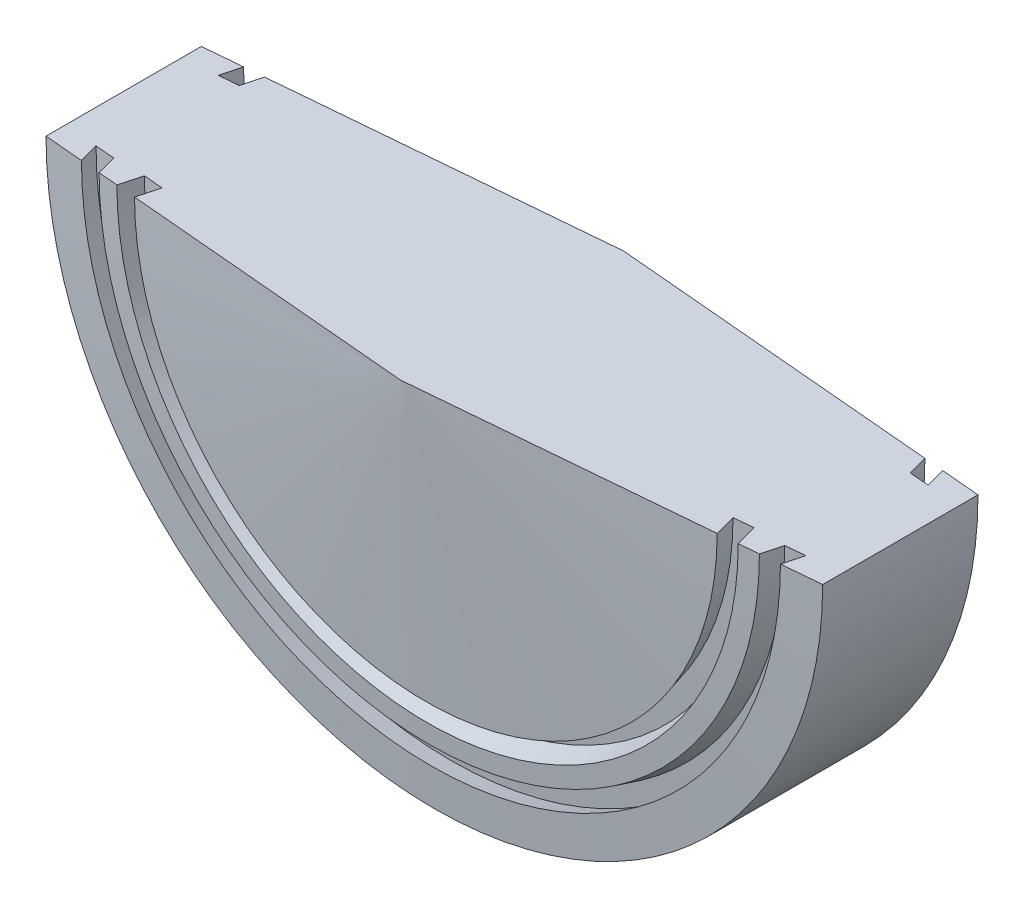
ISO-10303-21;
HEADER;
FILE_DESCRIPTION(('STEP AP214'),'2;1');
FILE_NAME('part.step','',(''),(''),'','','');
FILE_SCHEMA(('AUTOMOTIVE_DESIGN { 1 0 10303 214 1 1 1 1 }'));
ENDSEC;
DATA;
#1=APPLICATION_CONTEXT('core data for automotive mechanical design processes');
#2=APPLICATION_PROTOCOL_DEFINITION('international standard','automotive_design',2000,#1);
#3=PRODUCT_CONTEXT('',#1,'mechanical');
#4=PRODUCT('Part','Part','',(#3));
#5=PRODUCT_RELATED_PRODUCT_CATEGORY('part','',(#4));
#6=PRODUCT_DEFINITION_FORMATION('','',#4);
#7=PRODUCT_DEFINITION_CONTEXT('part definition',#1,'design');
#8=PRODUCT_DEFINITION('design','',#6,#7);
#9=PRODUCT_DEFINITION_SHAPE('','',#8);
#10=(LENGTH_UNIT() NAMED_UNIT(*) SI_UNIT(.MILLI.,.METRE.));
#11=(NAMED_UNIT(*) PLANE_ANGLE_UNIT() SI_UNIT($,.RADIAN.));
#12=(NAMED_UNIT(*) SI_UNIT($,.STERADIAN.) SOLID_ANGLE_UNIT());
#13=UNCERTAINTY_MEASURE_WITH_UNIT(LENGTH_MEASURE(1.E-05),#10,'distance_accuracy_value','');
#14=(GEOMETRIC_REPRESENTATION_CONTEXT(3) GLOBAL_UNCERTAINTY_ASSIGNED_CONTEXT((#13)) GLOBAL_UNIT_ASSIGNED_CONTEXT((#10,
#11,#12)) REPRESENTATION_CONTEXT('',''));
#15=CARTESIAN_POINT('',(0.,0.,0.));
#16=DIRECTION('',(0.,0.,1.));
#17=DIRECTION('',(1.,0.,0.));
#18=AXIS2_PLACEMENT_3D('',#15,#16,#17);
#19=CARTESIAN_POINT('',(0.,0.,18.25625));
#20=DIRECTION('',(0.,0.,-1.));
#21=DIRECTION('',(0.,1.,0.));
#22=AXIS2_PLACEMENT_3D('',#19,#20,#21);
#23=CONICAL_SURFACE('',#22,0.,1.48351861384544);
#24=CARTESIAN_POINT('',(0.,0.,14.0880050671419));
#25=DIRECTION('',(0.,0.,1.));
#26=DIRECTION('',(0.,-1.,0.));
#27=AXIS2_PLACEMENT_3D('',#24,#25,#26);
#28=CIRCLE('',#27,47.6370849469498);
#29=CARTESIAN_POINT('',(-47.6370849469498,1.69218207038058E-13,14.0880050671419));
#30=VERTEX_POINT('',#29);
#31=CARTESIAN_POINT('',(47.6370849469498,1.63736068582383E-13,14.0880050671419));
#32=VERTEX_POINT('',#31);
#33=EDGE_CURVE('E11',#30,#32,#28,.T.);
#34=ORIENTED_EDGE('',*,*,#33,.T.);
#35=DIRECTION('',(0.996193717496113,0.,-0.0871669502809096));
#36=VECTOR('',#35,1.);
#37=CARTESIAN_POINT('',(1.58528454023879,0.,18.1175376027291));
#38=LINE('',#37,#36);
#39=CARTESIAN_POINT('',(0.,0.,18.25625));
#40=VERTEX_POINT('',#39);
#41=EDGE_CURVE('E141',#40,#32,#38,.T.);
#42=ORIENTED_EDGE('',*,*,#41,.F.);
#43=DIRECTION('',(-0.996193717496113,0.,-0.0871669502809096));
#44=VECTOR('',#43,1.);
#45=CARTESIAN_POINT('',(-1.58528454023879,0.,18.1175376027291));
#46=LINE('',#45,#44);
#47=EDGE_CURVE('E143',#40,#30,#46,.T.);
#48=ORIENTED_EDGE('',*,*,#47,.T.);
#49=EDGE_LOOP('',(#34,#42,#48));
#50=FACE_BOUND('',#49,.T.);
#51=ADVANCED_FACE('F35',(#50),#23,.T.);
#52=CARTESIAN_POINT('',(0.,0.,10.545485948535));
#53=DIRECTION('',(0.,0.,1.));
#54=DIRECTION('',(0.,-1.,0.));
#55=AXIS2_PLACEMENT_3D('',#52,#53,#54);
#56=CONICAL_SURFACE('',#55,46.6878698099473,0.261799387799151);
#57=CARTESIAN_POINT('',(0.,0.,10.545485948535));
#58=DIRECTION('',(0.,0.,1.));
#59=DIRECTION('',(0.,-1.,0.));
#60=AXIS2_PLACEMENT_3D('',#57,#58,#59);
#61=CIRCLE('',#60,46.6878698099473);
#62=CARTESIAN_POINT('',(-46.6878698099473,1.66554790305594E-13,10.545485948535));
#63=VERTEX_POINT('',#62);
#64=CARTESIAN_POINT('',(46.6878698099473,1.6107265184992E-13,10.545485948535));
#65=VERTEX_POINT('',#64);
#66=EDGE_CURVE('E42',#63,#65,#61,.T.);
#67=ORIENTED_EDGE('',*,*,#66,.T.);
#68=DIRECTION('',(0.258819045102522,0.,0.965925826289068));
#69=VECTOR('',#68,1.);
#70=CARTESIAN_POINT('',(40.9240040698373,1.44899736082519E-13,-10.965553841561));
#71=LINE('',#70,#69);
#72=EDGE_CURVE('E151',#65,#32,#71,.T.);
#73=ORIENTED_EDGE('',*,*,#72,.T.);
#74=ORIENTED_EDGE('',*,*,#33,.F.);
#75=DIRECTION('',(-0.258819045102522,0.,0.965925826289068));
#76=VECTOR('',#75,1.);
#77=CARTESIAN_POINT('',(-40.9240040698373,1.50381874538193E-13,-10.965553841561));
#78=LINE('',#77,#76);
#79=EDGE_CURVE('E188',#63,#30,#78,.T.);
#80=ORIENTED_EDGE('',*,*,#79,.F.);
#81=EDGE_LOOP('',(#67,#73,#74,#80));
#82=FACE_BOUND('',#81,.T.);
#83=ADVANCED_FACE('F156',(#82),#56,.T.);
#84=CARTESIAN_POINT('',(0.,0.,10.2687308813931));
#85=DIRECTION('',(0.,0.,-1.));
#86=DIRECTION('',(0.,1.,0.));
#87=AXIS2_PLACEMENT_3D('',#84,#85,#86);
#88=CONICAL_SURFACE('',#87,49.8507848629974,1.48351861384544);
#89=CARTESIAN_POINT('',(0.,0.,10.2687308813931));
#90=DIRECTION('',(0.,0.,1.));
#91=DIRECTION('',(0.,-1.,0.));
#92=AXIS2_PLACEMENT_3D('',#89,#90,#91);
#93=CIRCLE('',#92,49.8507848629974);
#94=CARTESIAN_POINT('',(-49.8507848629974,1.77648888270733E-13,10.2687308813931));
#95=VERTEX_POINT('',#94);
#96=CARTESIAN_POINT('',(49.8507848629974,1.72166749815059E-13,10.2687308813931));
#97=VERTEX_POINT('',#96);
#98=EDGE_CURVE('E243',#95,#97,#93,.T.);
#99=ORIENTED_EDGE('',*,*,#98,.T.);
#100=DIRECTION('',(-0.996193717496113,0.,0.0871669502809094));
#101=VECTOR('',#100,1.);
#102=CARTESIAN_POINT('',(1.27045708665947,0.,14.5195095618226));
#103=LINE('',#102,#101);
#104=EDGE_CURVE('E157',#97,#65,#103,.T.);
#105=ORIENTED_EDGE('',*,*,#104,.T.);
#106=ORIENTED_EDGE('',*,*,#66,.F.);
#107=DIRECTION('',(0.996193717496113,0.,0.0871669502809094));
#108=VECTOR('',#107,1.);
#109=CARTESIAN_POINT('',(-1.27045708665947,0.,14.5195095618226));
#110=LINE('',#109,#108);
#111=EDGE_CURVE('E192',#95,#63,#110,.T.);
#112=ORIENTED_EDGE('',*,*,#111,.F.);
#113=EDGE_LOOP('',(#99,#105,#106,#112));
#114=FACE_BOUND('',#113,.T.);
#115=ADVANCED_FACE('F246',(#114),#88,.T.);
#116=CARTESIAN_POINT('',(0.,0.,13.81125));
#117=DIRECTION('',(0.,0.,1.));
#118=DIRECTION('',(0.,-1.,0.));
#119=AXIS2_PLACEMENT_3D('',#116,#117,#118);
#120=CONICAL_SURFACE('',#119,50.8,0.261799387799151);
#121=CARTESIAN_POINT('',(0.,0.,13.81125));
#122=DIRECTION('',(0.,0.,1.));
#123=DIRECTION('',(0.,-1.,0.));
#124=AXIS2_PLACEMENT_3D('',#121,#122,#123);
#125=CIRCLE('',#124,50.8);
#126=CARTESIAN_POINT('',(-50.8,1.80312305003197E-13,13.81125));
#127=VERTEX_POINT('',#126);
#128=CARTESIAN_POINT('',(50.8,1.74830166547523E-13,13.81125));
#129=VERTEX_POINT('',#128);
#130=EDGE_CURVE('E241',#127,#129,#125,.T.);
#131=ORIENTED_EDGE('',*,*,#130,.T.);
#132=DIRECTION('',(-0.258819045102522,0.,-0.965925826289068));
#133=VECTOR('',#132,1.);
#134=CARTESIAN_POINT('',(43.9442327561247,1.55593468269748E-13,-11.774821679009));
#135=LINE('',#134,#133);
#136=EDGE_CURVE('E159',#129,#97,#135,.T.);
#137=ORIENTED_EDGE('',*,*,#136,.T.);
#138=ORIENTED_EDGE('',*,*,#98,.F.);
#139=DIRECTION('',(0.258819045102522,0.,-0.965925826289068));
#140=VECTOR('',#139,1.);
#141=CARTESIAN_POINT('',(-43.9442327561247,1.61075606725422E-13,-11.774821679009));
#142=LINE('',#141,#140);
#143=EDGE_CURVE('E195',#127,#95,#142,.T.);
#144=ORIENTED_EDGE('',*,*,#143,.F.);
#145=EDGE_LOOP('',(#131,#137,#138,#144));
#146=FACE_BOUND('',#145,.T.);
#147=ADVANCED_FACE('F252',(#146),#120,.F.);
#148=CARTESIAN_POINT('',(0.,0.,13.81125));
#149=DIRECTION('',(0.,0.,-1.));
#150=DIRECTION('',(0.,1.,0.));
#151=AXIS2_PLACEMENT_3D('',#148,#149,#150);
#152=CONICAL_SURFACE('',#151,50.8,1.48351861384544);
#153=CARTESIAN_POINT('',(0.,0.,13.5323800671419));
#154=DIRECTION('',(0.,0.,1.));
#155=DIRECTION('',(0.,-1.,0.));
#156=AXIS2_PLACEMENT_3D('',#153,#154,#155);
#157=CIRCLE('',#156,53.9870849469498);
#158=CARTESIAN_POINT('',(-53.9870849469498,1.91491180196378E-13,13.5323800671419));
#159=VERTEX_POINT('',#158);
#160=CARTESIAN_POINT('',(53.9870849469498,1.86009041740704E-13,13.5323800671419));
#161=VERTEX_POINT('',#160);
#162=EDGE_CURVE('E239',#159,#161,#157,.T.);
#163=ORIENTED_EDGE('',*,*,#162,.T.);
#164=EDGE_CURVE('E155',#129,#161,#38,.T.);
#165=ORIENTED_EDGE('',*,*,#164,.F.);
#166=ORIENTED_EDGE('',*,*,#130,.F.);
#167=EDGE_CURVE('E190',#127,#159,#46,.T.);
#168=ORIENTED_EDGE('',*,*,#167,.T.);
#169=EDGE_LOOP('',(#163,#165,#166,#168));
#170=FACE_BOUND('',#169,.T.);
#171=ADVANCED_FACE('F256',(#170),#152,.T.);
#172=CARTESIAN_POINT('',(0.,0.,10.2687308813931));
#173=DIRECTION('',(0.,0.,-1.));
#174=DIRECTION('',(0.,1.,0.));
#175=AXIS2_PLACEMENT_3D('',#172,#173,#174);
#176=CONICAL_SURFACE('',#175,54.8615771106497,0.261799387799151);
#177=CARTESIAN_POINT('',(0.,0.,10.2687308813931));
#178=DIRECTION('',(0.,0.,1.));
#179=DIRECTION('',(0.,-1.,0.));
#180=AXIS2_PLACEMENT_3D('',#177,#178,#179);
#181=CIRCLE('',#180,54.8615771106497);
#182=CARTESIAN_POINT('',(-54.8615771106497,1.95143975896231E-13,10.2687308813931));
#183=VERTEX_POINT('',#182);
#184=CARTESIAN_POINT('',(54.8615771106497,1.89661837440557E-13,10.2687308813931));
#185=VERTEX_POINT('',#184);
#186=EDGE_CURVE('E237',#183,#185,#181,.T.);
#187=ORIENTED_EDGE('',*,*,#186,.T.);
#188=DIRECTION('',(-0.258819045102521,0.,0.965925826289069));
#189=VECTOR('',#188,1.);
#190=CARTESIAN_POINT('',(53.7537310104239,1.85034311158466E-13,14.4032688144029));
#191=LINE('',#190,#189);
#192=EDGE_CURVE('E164',#185,#161,#191,.T.);
#193=ORIENTED_EDGE('',*,*,#192,.T.);
#194=ORIENTED_EDGE('',*,*,#162,.F.);
#195=DIRECTION('',(0.258819045102521,0.,0.965925826289069));
#196=VECTOR('',#195,1.);
#197=CARTESIAN_POINT('',(-53.7537310104239,1.9051644961414E-13,14.4032688144029));
#198=LINE('',#197,#196);
#199=EDGE_CURVE('E198',#183,#159,#198,.T.);
#200=ORIENTED_EDGE('',*,*,#199,.F.);
#201=EDGE_LOOP('',(#187,#193,#194,#200));
#202=FACE_BOUND('',#201,.T.);
#203=ADVANCED_FACE('F306',(#202),#176,.T.);
#204=CARTESIAN_POINT('',(0.,0.,9.99197581425121));
#205=DIRECTION('',(0.,0.,-1.));
#206=DIRECTION('',(0.,1.,0.));
#207=AXIS2_PLACEMENT_3D('',#204,#205,#206);
#208=CONICAL_SURFACE('',#207,58.0244921636999,1.48351861384544);
#209=CARTESIAN_POINT('',(0.,0.,9.99197581425121));
#210=DIRECTION('',(0.,0.,1.));
#211=DIRECTION('',(0.,-1.,0.));
#212=AXIS2_PLACEMENT_3D('',#209,#210,#211);
#213=CIRCLE('',#212,58.0244921636999);
#214=CARTESIAN_POINT('',(-58.0244921636999,2.0623807386137E-13,9.99197581425121));
#215=VERTEX_POINT('',#214);
#216=CARTESIAN_POINT('',(58.0244921636999,2.00755935405696E-13,9.99197581425121));
#217=VERTEX_POINT('',#216);
#218=EDGE_CURVE('E235',#215,#217,#213,.T.);
#219=ORIENTED_EDGE('',*,*,#218,.T.);
#220=DIRECTION('',(-0.996193717496113,0.,0.0871669502809099));
#221=VECTOR('',#220,1.);
#222=CARTESIAN_POINT('',(1.30852947309691,0.,14.954622549679));
#223=LINE('',#222,#221);
#224=EDGE_CURVE('E167',#217,#185,#223,.T.);
#225=ORIENTED_EDGE('',*,*,#224,.T.);
#226=ORIENTED_EDGE('',*,*,#186,.F.);
#227=DIRECTION('',(0.996193717496113,0.,0.0871669502809099));
#228=VECTOR('',#227,1.);
#229=CARTESIAN_POINT('',(-1.30852947309691,0.,14.954622549679));
#230=LINE('',#229,#228);
#231=EDGE_CURVE('E201',#215,#183,#230,.T.);
#232=ORIENTED_EDGE('',*,*,#231,.F.);
#233=EDGE_LOOP('',(#219,#225,#226,#232));
#234=FACE_BOUND('',#233,.T.);
#235=ADVANCED_FACE('F309',(#234),#208,.T.);
#236=CARTESIAN_POINT('',(0.,0.,13.255625));
#237=DIRECTION('',(0.,0.,-1.));
#238=DIRECTION('',(0.,1.,0.));
#239=AXIS2_PLACEMENT_3D('',#236,#237,#238);
#240=CONICAL_SURFACE('',#239,57.15,0.261799387799153);
#241=CARTESIAN_POINT('',(0.,0.,13.255625));
#242=DIRECTION('',(0.,0.,1.));
#243=DIRECTION('',(0.,-1.,0.));
#244=AXIS2_PLACEMENT_3D('',#241,#242,#243);
#245=CIRCLE('',#244,57.15);
#246=CARTESIAN_POINT('',(-57.15,2.02585278161517E-13,13.255625));
#247=VERTEX_POINT('',#246);
#248=CARTESIAN_POINT('',(57.15,1.97103139705843E-13,13.255625));
#249=VERTEX_POINT('',#248);
#250=EDGE_CURVE('E233',#247,#249,#245,.T.);
#251=ORIENTED_EDGE('',*,*,#250,.T.);
#252=DIRECTION('',(0.258819045102521,0.,-0.965925826289069));
#253=VECTOR('',#252,1.);
#254=CARTESIAN_POINT('',(56.6355821631404,1.9495439173484E-13,15.1754585034799));
#255=LINE('',#254,#253);
#256=EDGE_CURVE('E170',#249,#217,#255,.T.);
#257=ORIENTED_EDGE('',*,*,#256,.T.);
#258=ORIENTED_EDGE('',*,*,#218,.F.);
#259=DIRECTION('',(-0.258819045102521,0.,-0.965925826289069));
#260=VECTOR('',#259,1.);
#261=CARTESIAN_POINT('',(-56.6355821631404,2.00436530190514E-13,15.1754585034799));
#262=LINE('',#261,#260);
#263=EDGE_CURVE('E204',#247,#215,#262,.T.);
#264=ORIENTED_EDGE('',*,*,#263,.F.);
#265=EDGE_LOOP('',(#251,#257,#258,#264));
#266=FACE_BOUND('',#265,.T.);
#267=ADVANCED_FACE('F313',(#266),#240,.F.);
#268=CARTESIAN_POINT('',(0.,0.,13.255625));
#269=DIRECTION('',(0.,0.,-1.));
#270=DIRECTION('',(0.,1.,0.));
#271=AXIS2_PLACEMENT_3D('',#268,#269,#270);
#272=CONICAL_SURFACE('',#271,57.15,1.48351861384543);
#273=CARTESIAN_POINT('',(0.,0.,12.7));
#274=DIRECTION('',(0.,0.,1.));
#275=DIRECTION('',(0.,-1.,0.));
#276=AXIS2_PLACEMENT_3D('',#273,#274,#275);
#277=CIRCLE('',#276,63.5);
#278=CARTESIAN_POINT('',(-63.5,2.24858251319837E-13,12.7));
#279=VERTEX_POINT('',#278);
#280=CARTESIAN_POINT('',(63.5,2.19376112864163E-13,12.7));
#281=VERTEX_POINT('',#280);
#282=EDGE_CURVE('E231',#279,#281,#277,.T.);
#283=ORIENTED_EDGE('',*,*,#282,.T.);
#284=EDGE_CURVE('E154',#249,#281,#38,.T.);
#285=ORIENTED_EDGE('',*,*,#284,.F.);
#286=ORIENTED_EDGE('',*,*,#250,.F.);
#287=EDGE_CURVE('E189',#247,#279,#46,.T.);
#288=ORIENTED_EDGE('',*,*,#287,.T.);
#289=EDGE_LOOP('',(#283,#285,#286,#288));
#290=FACE_BOUND('',#289,.T.);
#291=ADVANCED_FACE('F317',(#290),#272,.T.);
#292=CARTESIAN_POINT('',(0.,0.,18.25625));
#293=DIRECTION('',(0.,0.,1.));
#294=DIRECTION('',(0.,-1.,0.));
#295=AXIS2_PLACEMENT_3D('',#292,#293,#294);
#296=CYLINDRICAL_SURFACE('',#295,63.5);
#297=CARTESIAN_POINT('',(0.,0.,-12.7));
#298=DIRECTION('',(0.,0.,1.));
#299=DIRECTION('',(0.,-1.,0.));
#300=AXIS2_PLACEMENT_3D('',#297,#298,#299);
#301=CIRCLE('',#300,63.5);
#302=CARTESIAN_POINT('',(-63.5,2.29524155624589E-13,-12.7));
#303=VERTEX_POINT('',#302);
#304=CARTESIAN_POINT('',(63.5,2.24042017168915E-13,-12.7));
#305=VERTEX_POINT('',#304);
#306=EDGE_CURVE('E229',#303,#305,#301,.T.);
#307=ORIENTED_EDGE('',*,*,#306,.T.);
#308=DIRECTION('',(0.,0.,-1.));
#309=VECTOR('',#308,1.);
#310=CARTESIAN_POINT('',(63.5,2.21709065016539E-13,0.));
#311=LINE('',#310,#309);
#312=EDGE_CURVE('E173',#281,#305,#311,.T.);
#313=ORIENTED_EDGE('',*,*,#312,.F.);
#314=ORIENTED_EDGE('',*,*,#282,.F.);
#315=DIRECTION('',(0.,0.,-1.));
#316=VECTOR('',#315,1.);
#317=CARTESIAN_POINT('',(-63.5,2.27191203472213E-13,0.));
#318=LINE('',#317,#316);
#319=EDGE_CURVE('E207',#279,#303,#318,.T.);
#320=ORIENTED_EDGE('',*,*,#319,.T.);
#321=EDGE_LOOP('',(#307,#313,#314,#320));
#322=FACE_BOUND('',#321,.T.);
#323=ADVANCED_FACE('F266',(#322),#296,.T.);
#324=CARTESIAN_POINT('',(0.,0.,-12.7));
#325=DIRECTION('',(0.,0.,1.));
#326=DIRECTION('',(0.,-1.,0.));
#327=AXIS2_PLACEMENT_3D('',#324,#325,#326);
#328=CONICAL_SURFACE('',#327,63.5,1.48351861384543);
#329=CARTESIAN_POINT('',(0.,0.,-13.255625));
#330=DIRECTION('',(0.,0.,1.));
#331=DIRECTION('',(0.,-1.,0.));
#332=AXIS2_PLACEMENT_3D('',#329,#330,#331);
#333=CIRCLE('',#332,57.15);
#334=CARTESIAN_POINT('',(-57.15,2.07455315779601E-13,-13.255625));
#335=VERTEX_POINT('',#334);
#336=CARTESIAN_POINT('',(57.15,2.01973177323927E-13,-13.255625));
#337=VERTEX_POINT('',#336);
#338=EDGE_CURVE('E227',#335,#337,#333,.T.);
#339=ORIENTED_EDGE('',*,*,#338,.T.);
#340=DIRECTION('',(-0.996193717496113,0.,-0.0871669502809104));
#341=VECTOR('',#340,1.);
#342=CARTESIAN_POINT('',(1.58528454023881,0.,-18.1175376027291));
#343=LINE('',#342,#341);
#344=EDGE_CURVE('E176',#305,#337,#343,.T.);
#345=ORIENTED_EDGE('',*,*,#344,.F.);
#346=ORIENTED_EDGE('',*,*,#306,.F.);
#347=DIRECTION('',(0.996193717496113,0.,-0.0871669502809104));
#348=VECTOR('',#347,1.);
#349=CARTESIAN_POINT('',(-1.58528454023881,0.,-18.1175376027291));
#350=LINE('',#349,#348);
#351=EDGE_CURVE('E210',#303,#335,#350,.T.);
#352=ORIENTED_EDGE('',*,*,#351,.T.);
#353=EDGE_LOOP('',(#339,#345,#346,#352));
#354=FACE_BOUND('',#353,.T.);
#355=ADVANCED_FACE('F271',(#354),#328,.T.);
#356=CARTESIAN_POINT('',(0.,0.,-13.255625));
#357=DIRECTION('',(0.,0.,1.));
#358=DIRECTION('',(0.,-1.,0.));
#359=AXIS2_PLACEMENT_3D('',#356,#357,#358);
#360=CONICAL_SURFACE('',#359,57.15,0.261799387799147);
#361=CARTESIAN_POINT('',(0.,0.,-9.99197581425122));
#362=DIRECTION('',(0.,0.,1.));
#363=DIRECTION('',(0.,-1.,0.));
#364=AXIS2_PLACEMENT_3D('',#361,#362,#363);
#365=CIRCLE('',#364,58.0244921636999);
#366=CARTESIAN_POINT('',(-58.0244921636999,2.09909066220794E-13,-9.99197581425122));
#367=VERTEX_POINT('',#366);
#368=CARTESIAN_POINT('',(58.0244921636999,2.0442692776512E-13,-9.99197581425122));
#369=VERTEX_POINT('',#368);
#370=EDGE_CURVE('E225',#367,#369,#365,.T.);
#371=ORIENTED_EDGE('',*,*,#370,.T.);
#372=DIRECTION('',(0.258819045102517,0.,0.965925826289069));
#373=VECTOR('',#372,1.);
#374=CARTESIAN_POINT('',(56.6355821631404,2.00529764739404E-13,-15.1754585034797));
#375=LINE('',#374,#373);
#376=EDGE_CURVE('E179',#337,#369,#375,.T.);
#377=ORIENTED_EDGE('',*,*,#376,.F.);
#378=ORIENTED_EDGE('',*,*,#338,.F.);
#379=DIRECTION('',(-0.258819045102517,0.,0.965925826289069));
#380=VECTOR('',#379,1.);
#381=CARTESIAN_POINT('',(-56.6355821631404,2.06011903195078E-13,-15.1754585034797));
#382=LINE('',#381,#380);
#383=EDGE_CURVE('E213',#335,#367,#382,.T.);
#384=ORIENTED_EDGE('',*,*,#383,.T.);
#385=EDGE_LOOP('',(#371,#377,#378,#384));
#386=FACE_BOUND('',#385,.T.);
#387=ADVANCED_FACE('F276',(#386),#360,.F.);
#388=CARTESIAN_POINT('',(0.,0.,-9.99197581425122));
#389=DIRECTION('',(0.,0.,1.));
#390=DIRECTION('',(0.,-1.,0.));
#391=AXIS2_PLACEMENT_3D('',#388,#389,#390);
#392=CONICAL_SURFACE('',#391,58.0244921636999,1.48351861384544);
#393=CARTESIAN_POINT('',(0.,0.,-10.2687308813931));
#394=DIRECTION('',(0.,0.,1.));
#395=DIRECTION('',(0.,-1.,0.));
#396=AXIS2_PLACEMENT_3D('',#393,#394,#395);
#397=CIRCLE('',#396,54.8615771106497);
#398=CARTESIAN_POINT('',(-54.8615771106497,1.98916646417792E-13,-10.2687308813931));
#399=VERTEX_POINT('',#398);
#400=CARTESIAN_POINT('',(54.8615771106497,1.93434507962118E-13,-10.2687308813931));
#401=VERTEX_POINT('',#400);
#402=EDGE_CURVE('E223',#399,#401,#397,.T.);
#403=ORIENTED_EDGE('',*,*,#402,.T.);
#404=DIRECTION('',(-0.996193717496113,0.,-0.0871669502809097));
#405=VECTOR('',#404,1.);
#406=CARTESIAN_POINT('',(1.30852947309691,0.,-14.954622549679));
#407=LINE('',#406,#405);
#408=EDGE_CURVE('E182',#369,#401,#407,.T.);
#409=ORIENTED_EDGE('',*,*,#408,.F.);
#410=ORIENTED_EDGE('',*,*,#370,.F.);
#411=DIRECTION('',(0.996193717496113,0.,-0.0871669502809097));
#412=VECTOR('',#411,1.);
#413=CARTESIAN_POINT('',(-1.30852947309691,0.,-14.954622549679));
#414=LINE('',#413,#412);
#415=EDGE_CURVE('E217',#367,#399,#414,.T.);
#416=ORIENTED_EDGE('',*,*,#415,.T.);
#417=EDGE_LOOP('',(#403,#409,#410,#416));
#418=FACE_BOUND('',#417,.T.);
#419=ADVANCED_FACE('F279',(#418),#392,.T.);
#420=CARTESIAN_POINT('',(0.,0.,-10.2687308813931));
#421=DIRECTION('',(0.,0.,1.));
#422=DIRECTION('',(0.,-1.,0.));
#423=AXIS2_PLACEMENT_3D('',#420,#421,#422);
#424=CONICAL_SURFACE('',#423,54.8615771106497,0.261799387799151);
#425=CARTESIAN_POINT('',(0.,0.,-13.5323800671419));
#426=DIRECTION('',(0.,0.,1.));
#427=DIRECTION('',(0.,-1.,0.));
#428=AXIS2_PLACEMENT_3D('',#425,#426,#427);
#429=CIRCLE('',#428,53.9870849469498);
#430=CARTESIAN_POINT('',(-53.9870849469498,1.96462895976599E-13,-13.5323800671419));
#431=VERTEX_POINT('',#430);
#432=CARTESIAN_POINT('',(53.9870849469498,1.90980757520925E-13,-13.5323800671419));
#433=VERTEX_POINT('',#432);
#434=EDGE_CURVE('E55',#431,#433,#429,.T.);
#435=ORIENTED_EDGE('',*,*,#434,.T.);
#436=DIRECTION('',(-0.258819045102517,0.,-0.965925826289069));
#437=VECTOR('',#436,1.);
#438=CARTESIAN_POINT('',(53.753731010424,1.90325986273711E-13,-14.4032688144027));
#439=LINE('',#438,#437);
#440=EDGE_CURVE('E185',#401,#433,#439,.T.);
#441=ORIENTED_EDGE('',*,*,#440,.F.);
#442=ORIENTED_EDGE('',*,*,#402,.F.);
#443=DIRECTION('',(0.258819045102517,0.,-0.965925826289069));
#444=VECTOR('',#443,1.);
#445=CARTESIAN_POINT('',(-53.753731010424,1.95808124729385E-13,-14.4032688144027));
#446=LINE('',#445,#444);
#447=EDGE_CURVE('E220',#399,#431,#446,.T.);
#448=ORIENTED_EDGE('',*,*,#447,.T.);
#449=EDGE_LOOP('',(#435,#441,#442,#448));
#450=FACE_BOUND('',#449,.T.);
#451=ADVANCED_FACE('F283',(#450),#424,.T.);
#452=CARTESIAN_POINT('',(0.,0.,-13.5323800671419));
#453=DIRECTION('',(0.,0.,1.));
#454=DIRECTION('',(0.,-1.,0.));
#455=AXIS2_PLACEMENT_3D('',#452,#453,#454);
#456=CONICAL_SURFACE('',#455,53.9870849469498,1.48351861384543);
#457=CARTESIAN_POINT('',(0.,0.,-18.25625));
#458=VERTEX_POINT('',#457);
#459=EDGE_CURVE('E214',#431,#458,#350,.T.);
#460=ORIENTED_EDGE('',*,*,#459,.T.);
#461=EDGE_CURVE('E49',#433,#458,#343,.T.);
#462=ORIENTED_EDGE('',*,*,#461,.F.);
#463=ORIENTED_EDGE('',*,*,#434,.F.);
#464=EDGE_LOOP('',(#460,#462,#463));
#465=FACE_BOUND('',#464,.T.);
#466=ADVANCED_FACE('F284',(#465),#456,.T.);
#467=CARTESIAN_POINT('',(0.,0.,0.));
#468=DIRECTION('',(0.,-1.,0.));
#469=DIRECTION('',(0.,0.,-1.));
#470=AXIS2_PLACEMENT_3D('',#467,#468,#469);
#471=PLANE('',#470);
#472=ORIENTED_EDGE('',*,*,#47,.F.);
#473=ORIENTED_EDGE('',*,*,#41,.T.);
#474=ORIENTED_EDGE('',*,*,#72,.F.);
#475=ORIENTED_EDGE('',*,*,#104,.F.);
#476=ORIENTED_EDGE('',*,*,#136,.F.);
#477=ORIENTED_EDGE('',*,*,#164,.T.);
#478=ORIENTED_EDGE('',*,*,#192,.F.);
#479=ORIENTED_EDGE('',*,*,#224,.F.);
#480=ORIENTED_EDGE('',*,*,#256,.F.);
#481=ORIENTED_EDGE('',*,*,#284,.T.);
#482=ORIENTED_EDGE('',*,*,#312,.T.);
#483=ORIENTED_EDGE('',*,*,#344,.T.);
#484=ORIENTED_EDGE('',*,*,#376,.T.);
#485=ORIENTED_EDGE('',*,*,#408,.T.);
#486=ORIENTED_EDGE('',*,*,#440,.T.);
#487=ORIENTED_EDGE('',*,*,#461,.T.);
#488=ORIENTED_EDGE('',*,*,#459,.F.);
#489=ORIENTED_EDGE('',*,*,#447,.F.);
#490=ORIENTED_EDGE('',*,*,#415,.F.);
#491=ORIENTED_EDGE('',*,*,#383,.F.);
#492=ORIENTED_EDGE('',*,*,#351,.F.);
#493=ORIENTED_EDGE('',*,*,#319,.F.);
#494=ORIENTED_EDGE('',*,*,#287,.F.);
#495=ORIENTED_EDGE('',*,*,#263,.T.);
#496=ORIENTED_EDGE('',*,*,#231,.T.);
#497=ORIENTED_EDGE('',*,*,#199,.T.);
#498=ORIENTED_EDGE('',*,*,#167,.F.);
#499=ORIENTED_EDGE('',*,*,#143,.T.);
#500=ORIENTED_EDGE('',*,*,#111,.T.);
#501=ORIENTED_EDGE('',*,*,#79,.T.);
#502=EDGE_LOOP('',(#472,#473,#474,#475,#476,#477,#478,#479,#480,#481,#482,#483,#484,#485,#486,
#487,#488,#489,#490,#491,#492,#493,#494,#495,#496,#497,#498,#499,#500,#501));
#503=FACE_BOUND('',#502,.T.);
#504=ADVANCED_FACE('F149',(#503),#471,.F.);
#505=CLOSED_SHELL('',(#51,#83,#115,#147,#171,#203,#235,#267,#291,#323,#355,#387,#419,#451,#466,#504));
#506=MANIFOLD_SOLID_BREP('B2',#505);
#507=ADVANCED_BREP_SHAPE_REPRESENTATION('',(#18,#506),#14);
#508=SHAPE_DEFINITION_REPRESENTATION(#9,#507);
ENDSEC;
END-ISO-10303-21;
